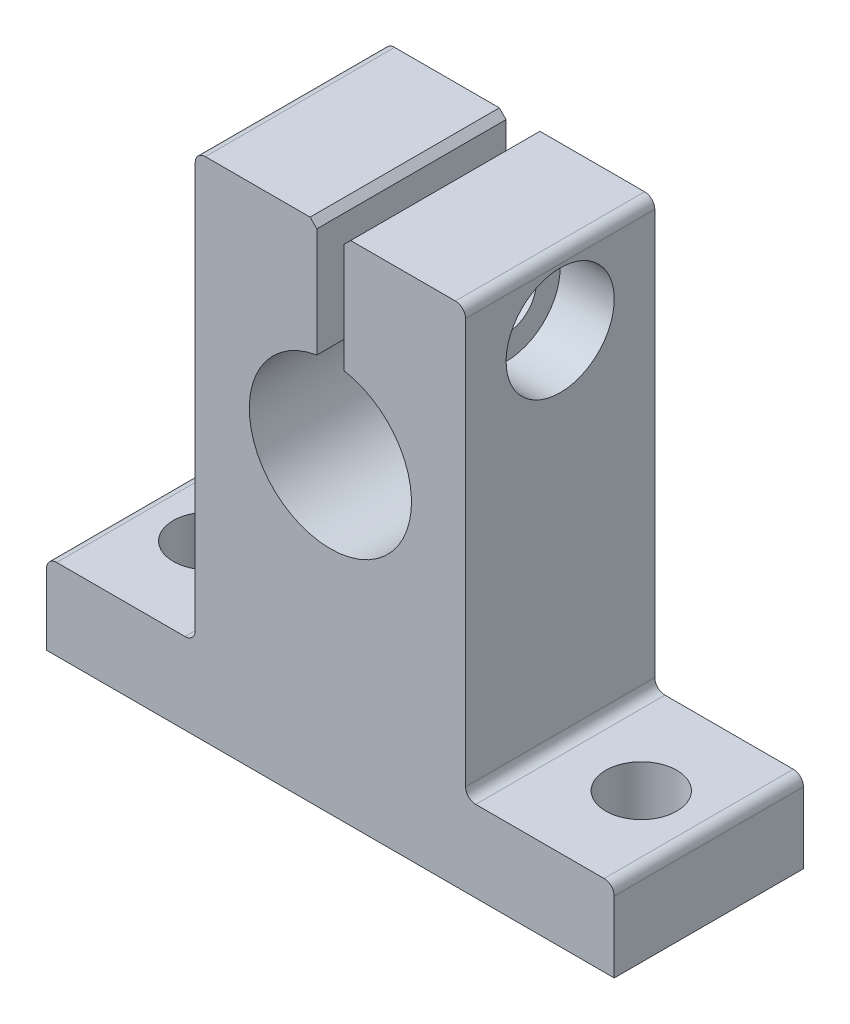
ISO-10303-21;
HEADER;
FILE_DESCRIPTION(('STEP AP214'),'2;1');
FILE_NAME('part.step','',(''),(''),'','','');
FILE_SCHEMA(('AUTOMOTIVE_DESIGN { 1 0 10303 214 1 1 1 1 }'));
ENDSEC;
DATA;
#1=APPLICATION_CONTEXT('core data for automotive mechanical design processes');
#2=APPLICATION_PROTOCOL_DEFINITION('international standard','automotive_design',2000,#1);
#3=PRODUCT_CONTEXT('',#1,'mechanical');
#4=PRODUCT('Part','Part','',(#3));
#5=PRODUCT_RELATED_PRODUCT_CATEGORY('part','',(#4));
#6=PRODUCT_DEFINITION_FORMATION('','',#4);
#7=PRODUCT_DEFINITION_CONTEXT('part definition',#1,'design');
#8=PRODUCT_DEFINITION('design','',#6,#7);
#9=PRODUCT_DEFINITION_SHAPE('','',#8);
#10=(LENGTH_UNIT() NAMED_UNIT(*) SI_UNIT(.MILLI.,.METRE.));
#11=(NAMED_UNIT(*) PLANE_ANGLE_UNIT() SI_UNIT($,.RADIAN.));
#12=(NAMED_UNIT(*) SI_UNIT($,.STERADIAN.) SOLID_ANGLE_UNIT());
#13=UNCERTAINTY_MEASURE_WITH_UNIT(LENGTH_MEASURE(1.E-05),#10,'distance_accuracy_value','');
#14=(GEOMETRIC_REPRESENTATION_CONTEXT(3) GLOBAL_UNCERTAINTY_ASSIGNED_CONTEXT((#13)) GLOBAL_UNIT_ASSIGNED_CONTEXT((#10,
#11,#12)) REPRESENTATION_CONTEXT('',''));
#15=CARTESIAN_POINT('',(0.,0.,0.));
#16=DIRECTION('',(0.,0.,1.));
#17=DIRECTION('',(1.,0.,0.));
#18=AXIS2_PLACEMENT_3D('',#15,#16,#17);
#19=CARTESIAN_POINT('',(10.,0.,14.));
#20=DIRECTION('',(-1.,0.,0.));
#21=DIRECTION('',(0.,-1.,0.));
#22=AXIS2_PLACEMENT_3D('',#19,#20,#21);
#23=PLANE('',#22);
#24=DIRECTION('',(0.,1.,0.));
#25=VECTOR('',#24,1.);
#26=CARTESIAN_POINT('',(10.,0.,14.));
#27=LINE('',#26,#25);
#28=CARTESIAN_POINT('',(10.,6.75,14.));
#29=VERTEX_POINT('',#28);
#30=CARTESIAN_POINT('',(10.,36.75,14.));
#31=VERTEX_POINT('',#30);
#32=EDGE_CURVE('E222',#29,#31,#27,.T.);
#33=ORIENTED_EDGE('',*,*,#32,.F.);
#34=DIRECTION('',(0.,0.,-1.));
#35=VECTOR('',#34,1.);
#36=CARTESIAN_POINT('',(10.,6.75,0.));
#37=LINE('',#36,#35);
#38=CARTESIAN_POINT('',(10.,6.75,0.));
#39=VERTEX_POINT('',#38);
#40=EDGE_CURVE('E262',#29,#39,#37,.T.);
#41=ORIENTED_EDGE('',*,*,#40,.T.);
#42=DIRECTION('',(0.,1.,0.));
#43=VECTOR('',#42,1.);
#44=CARTESIAN_POINT('',(10.,0.,0.));
#45=LINE('',#44,#43);
#46=CARTESIAN_POINT('',(10.,36.75,0.));
#47=VERTEX_POINT('',#46);
#48=EDGE_CURVE('E251',#39,#47,#45,.T.);
#49=ORIENTED_EDGE('',*,*,#48,.T.);
#50=DIRECTION('',(0.,0.,-1.));
#51=VECTOR('',#50,1.);
#52=CARTESIAN_POINT('',(10.,36.75,14.));
#53=LINE('',#52,#51);
#54=EDGE_CURVE('E184',#47,#31,#53,.F.);
#55=ORIENTED_EDGE('',*,*,#54,.T.);
#56=EDGE_LOOP('',(#33,#41,#49,#55));
#57=FACE_BOUND('',#56,.T.);
#58=CARTESIAN_POINT('',(10.,32.5,7.));
#59=DIRECTION('',(-1.,0.,0.));
#60=DIRECTION('',(0.,-1.,0.));
#61=AXIS2_PLACEMENT_3D('',#58,#59,#60);
#62=CIRCLE('',#61,4.);
#63=CARTESIAN_POINT('',(10.,28.5,7.));
#64=VERTEX_POINT('',#63);
#65=EDGE_CURVE('E679',#64,#64,#62,.T.);
#66=ORIENTED_EDGE('',*,*,#65,.T.);
#67=EDGE_LOOP('',(#66));
#68=FACE_BOUND('',#67,.T.);
#69=ADVANCED_FACE('F38',(#57,#68),#23,.F.);
#70=CARTESIAN_POINT('',(0.,23.,14.));
#71=DIRECTION('',(0.,0.,-1.));
#72=DIRECTION('',(-1.,0.,0.));
#73=AXIS2_PLACEMENT_3D('',#70,#71,#72);
#74=CYLINDRICAL_SURFACE('',#73,6.);
#75=CARTESIAN_POINT('',(0.,23.,0.));
#76=DIRECTION('',(0.,0.,1.));
#77=DIRECTION('',(1.,0.,0.));
#78=AXIS2_PLACEMENT_3D('',#75,#76,#77);
#79=CIRCLE('',#78,6.);
#80=CARTESIAN_POINT('',(-0.999999999999999,28.9160797830996,0.));
#81=VERTEX_POINT('',#80);
#82=CARTESIAN_POINT('',(1.,28.9160797830996,0.));
#83=VERTEX_POINT('',#82);
#84=EDGE_CURVE('E182',#81,#83,#79,.T.);
#85=ORIENTED_EDGE('',*,*,#84,.F.);
#86=DIRECTION('',(0.,0.,-1.));
#87=VECTOR('',#86,1.);
#88=CARTESIAN_POINT('',(-0.999999999999999,28.9160797830996,14.));
#89=LINE('',#88,#87);
#90=CARTESIAN_POINT('',(-0.999999999999999,28.9160797830996,14.));
#91=VERTEX_POINT('',#90);
#92=EDGE_CURVE('E176',#91,#81,#89,.T.);
#93=ORIENTED_EDGE('',*,*,#92,.F.);
#94=CARTESIAN_POINT('',(0.,23.,14.));
#95=DIRECTION('',(0.,0.,1.));
#96=DIRECTION('',(1.,0.,0.));
#97=AXIS2_PLACEMENT_3D('',#94,#95,#96);
#98=CIRCLE('',#97,6.);
#99=CARTESIAN_POINT('',(1.,28.9160797830996,14.));
#100=VERTEX_POINT('',#99);
#101=EDGE_CURVE('E180',#91,#100,#98,.T.);
#102=ORIENTED_EDGE('',*,*,#101,.T.);
#103=DIRECTION('',(0.,0.,-1.));
#104=VECTOR('',#103,1.);
#105=CARTESIAN_POINT('',(1.,28.9160797830996,14.));
#106=LINE('',#105,#104);
#107=EDGE_CURVE('E228',#100,#83,#106,.T.);
#108=ORIENTED_EDGE('',*,*,#107,.T.);
#109=EDGE_LOOP('',(#85,#93,#102,#108));
#110=FACE_BOUND('',#109,.T.);
#111=ADVANCED_FACE('F177',(#110),#74,.F.);
#112=CARTESIAN_POINT('',(-0.999999999999999,0.,14.));
#113=DIRECTION('',(-1.,0.,0.));
#114=DIRECTION('',(0.,0.,1.));
#115=AXIS2_PLACEMENT_3D('',#112,#113,#114);
#116=PLANE('',#115);
#117=CARTESIAN_POINT('',(-0.999999999999998,32.5,7.));
#118=DIRECTION('',(1.,0.,0.));
#119=DIRECTION('',(0.,0.,-1.));
#120=AXIS2_PLACEMENT_3D('',#117,#118,#119);
#121=CIRCLE('',#120,1.64999999999999);
#122=CARTESIAN_POINT('',(-0.999999999999998,32.5,5.35000000000001));
#123=VERTEX_POINT('',#122);
#124=EDGE_CURVE('E662',#123,#123,#121,.T.);
#125=ORIENTED_EDGE('',*,*,#124,.F.);
#126=EDGE_LOOP('',(#125));
#127=FACE_BOUND('',#126,.T.);
#128=DIRECTION('',(0.,1.,0.));
#129=VECTOR('',#128,1.);
#130=CARTESIAN_POINT('',(-0.999999999999999,0.,0.));
#131=LINE('',#130,#129);
#132=CARTESIAN_POINT('',(-0.999999999999999,37.,0.));
#133=VERTEX_POINT('',#132);
#134=EDGE_CURVE('E230',#81,#133,#131,.T.);
#135=ORIENTED_EDGE('',*,*,#134,.T.);
#136=DIRECTION('',(0.,0.,1.));
#137=VECTOR('',#136,1.);
#138=CARTESIAN_POINT('',(-0.999999999999999,37.,14.));
#139=LINE('',#138,#137);
#140=CARTESIAN_POINT('',(-0.999999999999998,37.,14.));
#141=VERTEX_POINT('',#140);
#142=EDGE_CURVE('E11',#133,#141,#139,.T.);
#143=ORIENTED_EDGE('',*,*,#142,.T.);
#144=DIRECTION('',(0.,1.,0.));
#145=VECTOR('',#144,1.);
#146=CARTESIAN_POINT('',(-0.999999999999999,0.,14.));
#147=LINE('',#146,#145);
#148=EDGE_CURVE('E187',#91,#141,#147,.T.);
#149=ORIENTED_EDGE('',*,*,#148,.F.);
#150=ORIENTED_EDGE('',*,*,#92,.T.);
#151=EDGE_LOOP('',(#135,#143,#149,#150));
#152=FACE_BOUND('',#151,.T.);
#153=ADVANCED_FACE('F188',(#127,#152),#116,.F.);
#154=CARTESIAN_POINT('',(0.,37.5,14.));
#155=DIRECTION('',(0.,-1.,0.));
#156=DIRECTION('',(1.,0.,0.));
#157=AXIS2_PLACEMENT_3D('',#154,#155,#156);
#158=PLANE('',#157);
#159=DIRECTION('',(-1.,0.,0.));
#160=VECTOR('',#159,1.);
#161=CARTESIAN_POINT('',(0.,37.5,14.));
#162=LINE('',#161,#160);
#163=CARTESIAN_POINT('',(-1.5,37.5,14.));
#164=VERTEX_POINT('',#163);
#165=CARTESIAN_POINT('',(-9.24999999999998,37.5,14.));
#166=VERTEX_POINT('',#165);
#167=EDGE_CURVE('E189',#164,#166,#162,.T.);
#168=ORIENTED_EDGE('',*,*,#167,.F.);
#169=DIRECTION('',(0.,0.,-1.));
#170=VECTOR('',#169,1.);
#171=CARTESIAN_POINT('',(-1.49999999999999,37.5,14.));
#172=LINE('',#171,#170);
#173=CARTESIAN_POINT('',(-1.49999999999999,37.5,0.));
#174=VERTEX_POINT('',#173);
#175=EDGE_CURVE('E47',#164,#174,#172,.T.);
#176=ORIENTED_EDGE('',*,*,#175,.T.);
#177=DIRECTION('',(-1.,0.,0.));
#178=VECTOR('',#177,1.);
#179=CARTESIAN_POINT('',(0.,37.5,0.));
#180=LINE('',#179,#178);
#181=CARTESIAN_POINT('',(-9.24999999999998,37.5,0.));
#182=VERTEX_POINT('',#181);
#183=EDGE_CURVE('E232',#174,#182,#180,.T.);
#184=ORIENTED_EDGE('',*,*,#183,.T.);
#185=DIRECTION('',(0.,0.,-1.));
#186=VECTOR('',#185,1.);
#187=CARTESIAN_POINT('',(-9.24999999999998,37.5,14.));
#188=LINE('',#187,#186);
#189=EDGE_CURVE('E305',#182,#166,#188,.F.);
#190=ORIENTED_EDGE('',*,*,#189,.T.);
#191=EDGE_LOOP('',(#168,#176,#184,#190));
#192=FACE_BOUND('',#191,.T.);
#193=ADVANCED_FACE('F332',(#192),#158,.F.);
#194=CARTESIAN_POINT('',(-10.,0.,14.));
#195=DIRECTION('',(-1.,0.,0.));
#196=DIRECTION('',(0.,-1.,0.));
#197=AXIS2_PLACEMENT_3D('',#194,#195,#196);
#198=PLANE('',#197);
#199=CARTESIAN_POINT('',(-9.99999999999999,32.5,7.));
#200=DIRECTION('',(-1.,0.,0.));
#201=DIRECTION('',(0.,-1.,0.));
#202=AXIS2_PLACEMENT_3D('',#199,#200,#201);
#203=CIRCLE('',#202,1.64999999999999);
#204=CARTESIAN_POINT('',(-9.99999999999999,30.85,7.));
#205=VERTEX_POINT('',#204);
#206=EDGE_CURVE('E201',#205,#205,#203,.T.);
#207=ORIENTED_EDGE('',*,*,#206,.F.);
#208=EDGE_LOOP('',(#207));
#209=FACE_BOUND('',#208,.T.);
#210=DIRECTION('',(0.,1.,0.));
#211=VECTOR('',#210,1.);
#212=CARTESIAN_POINT('',(-10.,0.,0.));
#213=LINE('',#212,#211);
#214=CARTESIAN_POINT('',(-10.,6.75,0.));
#215=VERTEX_POINT('',#214);
#216=CARTESIAN_POINT('',(-9.99999999999998,36.75,0.));
#217=VERTEX_POINT('',#216);
#218=EDGE_CURVE('E234',#215,#217,#213,.T.);
#219=ORIENTED_EDGE('',*,*,#218,.F.);
#220=DIRECTION('',(0.,0.,-1.));
#221=VECTOR('',#220,1.);
#222=CARTESIAN_POINT('',(-10.,6.75,14.));
#223=LINE('',#222,#221);
#224=CARTESIAN_POINT('',(-10.,6.75,14.));
#225=VERTEX_POINT('',#224);
#226=EDGE_CURVE('E278',#215,#225,#223,.F.);
#227=ORIENTED_EDGE('',*,*,#226,.T.);
#228=DIRECTION('',(0.,1.,0.));
#229=VECTOR('',#228,1.);
#230=CARTESIAN_POINT('',(-10.,0.,14.));
#231=LINE('',#230,#229);
#232=CARTESIAN_POINT('',(-9.99999999999998,36.75,14.));
#233=VERTEX_POINT('',#232);
#234=EDGE_CURVE('E205',#225,#233,#231,.T.);
#235=ORIENTED_EDGE('',*,*,#234,.T.);
#236=DIRECTION('',(0.,0.,-1.));
#237=VECTOR('',#236,1.);
#238=CARTESIAN_POINT('',(-9.99999999999998,36.75,0.));
#239=LINE('',#238,#237);
#240=EDGE_CURVE('E275',#233,#217,#239,.T.);
#241=ORIENTED_EDGE('',*,*,#240,.T.);
#242=EDGE_LOOP('',(#219,#227,#235,#241));
#243=FACE_BOUND('',#242,.T.);
#244=ADVANCED_FACE('F346',(#209,#243),#198,.T.);
#245=CARTESIAN_POINT('',(0.,5.99999999999998,14.));
#246=DIRECTION('',(0.,1.,0.));
#247=DIRECTION('',(-1.,0.,0.));
#248=AXIS2_PLACEMENT_3D('',#245,#246,#247);
#249=PLANE('',#248);
#250=CARTESIAN_POINT('',(-16.,6.00000000000001,7.));
#251=DIRECTION('',(0.,1.,0.));
#252=DIRECTION('',(-1.,0.,0.));
#253=AXIS2_PLACEMENT_3D('',#250,#251,#252);
#254=CIRCLE('',#253,2.625);
#255=CARTESIAN_POINT('',(-18.625,6.00000000000001,7.));
#256=VERTEX_POINT('',#255);
#257=EDGE_CURVE('E665',#256,#256,#254,.T.);
#258=ORIENTED_EDGE('',*,*,#257,.F.);
#259=EDGE_LOOP('',(#258));
#260=FACE_BOUND('',#259,.T.);
#261=DIRECTION('',(1.,0.,0.));
#262=VECTOR('',#261,1.);
#263=CARTESIAN_POINT('',(0.,5.99999999999998,14.));
#264=LINE('',#263,#262);
#265=CARTESIAN_POINT('',(-20.25,6.00000000000001,14.));
#266=VERTEX_POINT('',#265);
#267=CARTESIAN_POINT('',(-10.75,6.,14.));
#268=VERTEX_POINT('',#267);
#269=EDGE_CURVE('E208',#266,#268,#264,.T.);
#270=ORIENTED_EDGE('',*,*,#269,.T.);
#271=DIRECTION('',(0.,0.,-1.));
#272=VECTOR('',#271,1.);
#273=CARTESIAN_POINT('',(-10.75,6.,0.));
#274=LINE('',#273,#272);
#275=CARTESIAN_POINT('',(-10.75,6.,0.));
#276=VERTEX_POINT('',#275);
#277=EDGE_CURVE('E272',#268,#276,#274,.T.);
#278=ORIENTED_EDGE('',*,*,#277,.T.);
#279=DIRECTION('',(1.,0.,0.));
#280=VECTOR('',#279,1.);
#281=CARTESIAN_POINT('',(0.,5.99999999999998,0.));
#282=LINE('',#281,#280);
#283=CARTESIAN_POINT('',(-20.25,6.00000000000001,0.));
#284=VERTEX_POINT('',#283);
#285=EDGE_CURVE('E237',#284,#276,#282,.T.);
#286=ORIENTED_EDGE('',*,*,#285,.F.);
#287=DIRECTION('',(0.,0.,-1.));
#288=VECTOR('',#287,1.);
#289=CARTESIAN_POINT('',(-20.25,6.00000000000001,14.));
#290=LINE('',#289,#288);
#291=EDGE_CURVE('E270',#284,#266,#290,.F.);
#292=ORIENTED_EDGE('',*,*,#291,.T.);
#293=EDGE_LOOP('',(#270,#278,#286,#292));
#294=FACE_BOUND('',#293,.T.);
#295=ADVANCED_FACE('F354',(#260,#294),#249,.T.);
#296=CARTESIAN_POINT('',(-21.,0.,14.));
#297=DIRECTION('',(-1.,0.,0.));
#298=DIRECTION('',(0.,0.,1.));
#299=AXIS2_PLACEMENT_3D('',#296,#297,#298);
#300=PLANE('',#299);
#301=DIRECTION('',(0.,1.,0.));
#302=VECTOR('',#301,1.);
#303=CARTESIAN_POINT('',(-21.,0.,14.));
#304=LINE('',#303,#302);
#305=CARTESIAN_POINT('',(-21.,0.,14.));
#306=VERTEX_POINT('',#305);
#307=CARTESIAN_POINT('',(-21.,5.25000000000001,14.));
#308=VERTEX_POINT('',#307);
#309=EDGE_CURVE('E211',#306,#308,#304,.T.);
#310=ORIENTED_EDGE('',*,*,#309,.T.);
#311=DIRECTION('',(0.,0.,-1.));
#312=VECTOR('',#311,1.);
#313=CARTESIAN_POINT('',(-21.,5.25000000000001,14.));
#314=LINE('',#313,#312);
#315=CARTESIAN_POINT('',(-21.,5.25000000000001,0.));
#316=VERTEX_POINT('',#315);
#317=EDGE_CURVE('E280',#308,#316,#314,.T.);
#318=ORIENTED_EDGE('',*,*,#317,.T.);
#319=DIRECTION('',(0.,1.,0.));
#320=VECTOR('',#319,1.);
#321=CARTESIAN_POINT('',(-21.,0.,0.));
#322=LINE('',#321,#320);
#323=CARTESIAN_POINT('',(-21.,0.,0.));
#324=VERTEX_POINT('',#323);
#325=EDGE_CURVE('E240',#324,#316,#322,.T.);
#326=ORIENTED_EDGE('',*,*,#325,.F.);
#327=DIRECTION('',(0.,0.,-1.));
#328=VECTOR('',#327,1.);
#329=CARTESIAN_POINT('',(-21.,0.,14.));
#330=LINE('',#329,#328);
#331=EDGE_CURVE('E185',#306,#324,#330,.T.);
#332=ORIENTED_EDGE('',*,*,#331,.F.);
#333=EDGE_LOOP('',(#310,#318,#326,#332));
#334=FACE_BOUND('',#333,.T.);
#335=ADVANCED_FACE('F362',(#334),#300,.T.);
#336=CARTESIAN_POINT('',(0.,0.,14.));
#337=DIRECTION('',(0.,1.,0.));
#338=DIRECTION('',(-1.,0.,0.));
#339=AXIS2_PLACEMENT_3D('',#336,#337,#338);
#340=PLANE('',#339);
#341=CARTESIAN_POINT('',(16.,0.,7.));
#342=DIRECTION('',(0.,1.,0.));
#343=DIRECTION('',(-1.,0.,0.));
#344=AXIS2_PLACEMENT_3D('',#341,#342,#343);
#345=CIRCLE('',#344,2.625);
#346=CARTESIAN_POINT('',(13.375,0.,7.));
#347=VERTEX_POINT('',#346);
#348=EDGE_CURVE('E670',#347,#347,#345,.F.);
#349=ORIENTED_EDGE('',*,*,#348,.F.);
#350=EDGE_LOOP('',(#349));
#351=FACE_BOUND('',#350,.T.);
#352=CARTESIAN_POINT('',(-16.,0.,7.));
#353=DIRECTION('',(0.,1.,0.));
#354=DIRECTION('',(-1.,0.,0.));
#355=AXIS2_PLACEMENT_3D('',#352,#353,#354);
#356=CIRCLE('',#355,2.625);
#357=CARTESIAN_POINT('',(-18.625,0.,7.));
#358=VERTEX_POINT('',#357);
#359=EDGE_CURVE('E663',#358,#358,#356,.F.);
#360=ORIENTED_EDGE('',*,*,#359,.F.);
#361=EDGE_LOOP('',(#360));
#362=FACE_BOUND('',#361,.T.);
#363=DIRECTION('',(1.,0.,0.));
#364=VECTOR('',#363,1.);
#365=CARTESIAN_POINT('',(0.,0.,0.));
#366=LINE('',#365,#364);
#367=CARTESIAN_POINT('',(21.,0.,0.));
#368=VERTEX_POINT('',#367);
#369=EDGE_CURVE('E243',#324,#368,#366,.T.);
#370=ORIENTED_EDGE('',*,*,#369,.T.);
#371=DIRECTION('',(0.,0.,-1.));
#372=VECTOR('',#371,1.);
#373=CARTESIAN_POINT('',(21.,0.,14.));
#374=LINE('',#373,#372);
#375=CARTESIAN_POINT('',(21.,0.,14.));
#376=VERTEX_POINT('',#375);
#377=EDGE_CURVE('E257',#376,#368,#374,.T.);
#378=ORIENTED_EDGE('',*,*,#377,.F.);
#379=DIRECTION('',(1.,0.,0.));
#380=VECTOR('',#379,1.);
#381=CARTESIAN_POINT('',(0.,0.,14.));
#382=LINE('',#381,#380);
#383=EDGE_CURVE('E214',#306,#376,#382,.T.);
#384=ORIENTED_EDGE('',*,*,#383,.F.);
#385=ORIENTED_EDGE('',*,*,#331,.T.);
#386=EDGE_LOOP('',(#370,#378,#384,#385));
#387=FACE_BOUND('',#386,.T.);
#388=ADVANCED_FACE('F368',(#351,#362,#387),#340,.F.);
#389=CARTESIAN_POINT('',(21.,0.,14.));
#390=DIRECTION('',(-1.,0.,0.));
#391=DIRECTION('',(0.,0.,1.));
#392=AXIS2_PLACEMENT_3D('',#389,#390,#391);
#393=PLANE('',#392);
#394=DIRECTION('',(0.,1.,0.));
#395=VECTOR('',#394,1.);
#396=CARTESIAN_POINT('',(21.,0.,0.));
#397=LINE('',#396,#395);
#398=CARTESIAN_POINT('',(21.,5.25,0.));
#399=VERTEX_POINT('',#398);
#400=EDGE_CURVE('E245',#368,#399,#397,.T.);
#401=ORIENTED_EDGE('',*,*,#400,.T.);
#402=DIRECTION('',(0.,0.,-1.));
#403=VECTOR('',#402,1.);
#404=CARTESIAN_POINT('',(21.,5.25,14.));
#405=LINE('',#404,#403);
#406=CARTESIAN_POINT('',(21.,5.25,14.));
#407=VERTEX_POINT('',#406);
#408=EDGE_CURVE('E300',#399,#407,#405,.F.);
#409=ORIENTED_EDGE('',*,*,#408,.T.);
#410=DIRECTION('',(0.,1.,0.));
#411=VECTOR('',#410,1.);
#412=CARTESIAN_POINT('',(21.,0.,14.));
#413=LINE('',#412,#411);
#414=EDGE_CURVE('E216',#376,#407,#413,.T.);
#415=ORIENTED_EDGE('',*,*,#414,.F.);
#416=ORIENTED_EDGE('',*,*,#377,.T.);
#417=EDGE_LOOP('',(#401,#409,#415,#416));
#418=FACE_BOUND('',#417,.T.);
#419=ADVANCED_FACE('F426',(#418),#393,.F.);
#420=CARTESIAN_POINT('',(0.,5.99999999999999,14.));
#421=DIRECTION('',(0.,-1.,0.));
#422=DIRECTION('',(1.,0.,0.));
#423=AXIS2_PLACEMENT_3D('',#420,#421,#422);
#424=PLANE('',#423);
#425=CARTESIAN_POINT('',(16.,5.99999999999996,7.));
#426=DIRECTION('',(0.,1.,0.));
#427=DIRECTION('',(1.,0.,0.));
#428=AXIS2_PLACEMENT_3D('',#425,#426,#427);
#429=CIRCLE('',#428,2.625);
#430=CARTESIAN_POINT('',(18.625,5.99999999999995,7.));
#431=VERTEX_POINT('',#430);
#432=EDGE_CURVE('E673',#431,#431,#429,.T.);
#433=ORIENTED_EDGE('',*,*,#432,.F.);
#434=EDGE_LOOP('',(#433));
#435=FACE_BOUND('',#434,.T.);
#436=DIRECTION('',(-1.,0.,0.));
#437=VECTOR('',#436,1.);
#438=CARTESIAN_POINT('',(0.,5.99999999999999,0.));
#439=LINE('',#438,#437);
#440=CARTESIAN_POINT('',(20.25,6.,0.));
#441=VERTEX_POINT('',#440);
#442=CARTESIAN_POINT('',(10.75,6.,0.));
#443=VERTEX_POINT('',#442);
#444=EDGE_CURVE('E248',#441,#443,#439,.T.);
#445=ORIENTED_EDGE('',*,*,#444,.T.);
#446=DIRECTION('',(0.,0.,-1.));
#447=VECTOR('',#446,1.);
#448=CARTESIAN_POINT('',(10.75,6.,14.));
#449=LINE('',#448,#447);
#450=CARTESIAN_POINT('',(10.75,6.,14.));
#451=VERTEX_POINT('',#450);
#452=EDGE_CURVE('E268',#443,#451,#449,.F.);
#453=ORIENTED_EDGE('',*,*,#452,.T.);
#454=DIRECTION('',(-1.,0.,0.));
#455=VECTOR('',#454,1.);
#456=CARTESIAN_POINT('',(0.,5.99999999999999,14.));
#457=LINE('',#456,#455);
#458=CARTESIAN_POINT('',(20.25,6.,14.));
#459=VERTEX_POINT('',#458);
#460=EDGE_CURVE('E219',#459,#451,#457,.T.);
#461=ORIENTED_EDGE('',*,*,#460,.F.);
#462=DIRECTION('',(0.,0.,-1.));
#463=VECTOR('',#462,1.);
#464=CARTESIAN_POINT('',(20.25,6.,14.));
#465=LINE('',#464,#463);
#466=EDGE_CURVE('E265',#459,#441,#465,.T.);
#467=ORIENTED_EDGE('',*,*,#466,.T.);
#468=EDGE_LOOP('',(#445,#453,#461,#467));
#469=FACE_BOUND('',#468,.T.);
#470=ADVANCED_FACE('F379',(#435,#469),#424,.F.);
#471=CARTESIAN_POINT('',(0.,37.5,14.));
#472=DIRECTION('',(0.,-1.,0.));
#473=DIRECTION('',(1.,0.,0.));
#474=AXIS2_PLACEMENT_3D('',#471,#472,#473);
#475=PLANE('',#474);
#476=DIRECTION('',(-1.,0.,0.));
#477=VECTOR('',#476,1.);
#478=CARTESIAN_POINT('',(0.,37.5,0.));
#479=LINE('',#478,#477);
#480=CARTESIAN_POINT('',(9.25,37.5,0.));
#481=VERTEX_POINT('',#480);
#482=CARTESIAN_POINT('',(1.49999999999999,37.5,0.));
#483=VERTEX_POINT('',#482);
#484=EDGE_CURVE('E198',#481,#483,#479,.T.);
#485=ORIENTED_EDGE('',*,*,#484,.T.);
#486=DIRECTION('',(0.,0.,1.));
#487=VECTOR('',#486,1.);
#488=CARTESIAN_POINT('',(1.49999999999999,37.5,14.));
#489=LINE('',#488,#487);
#490=CARTESIAN_POINT('',(1.5,37.5,14.));
#491=VERTEX_POINT('',#490);
#492=EDGE_CURVE('E323',#483,#491,#489,.T.);
#493=ORIENTED_EDGE('',*,*,#492,.T.);
#494=DIRECTION('',(-1.,0.,0.));
#495=VECTOR('',#494,1.);
#496=CARTESIAN_POINT('',(0.,37.5,14.));
#497=LINE('',#496,#495);
#498=CARTESIAN_POINT('',(9.25,37.5,14.));
#499=VERTEX_POINT('',#498);
#500=EDGE_CURVE('E225',#499,#491,#497,.T.);
#501=ORIENTED_EDGE('',*,*,#500,.F.);
#502=DIRECTION('',(0.,0.,-1.));
#503=VECTOR('',#502,1.);
#504=CARTESIAN_POINT('',(9.25,37.5,14.));
#505=LINE('',#504,#503);
#506=EDGE_CURVE('E302',#499,#481,#505,.T.);
#507=ORIENTED_EDGE('',*,*,#506,.T.);
#508=EDGE_LOOP('',(#485,#493,#501,#507));
#509=FACE_BOUND('',#508,.T.);
#510=ADVANCED_FACE('F398',(#509),#475,.F.);
#511=CARTESIAN_POINT('',(1.00000000000001,0.,14.));
#512=DIRECTION('',(1.,0.,0.));
#513=DIRECTION('',(0.,1.,0.));
#514=AXIS2_PLACEMENT_3D('',#511,#512,#513);
#515=PLANE('',#514);
#516=CARTESIAN_POINT('',(1.,32.5,7.));
#517=DIRECTION('',(1.,0.,0.));
#518=DIRECTION('',(0.,1.,0.));
#519=AXIS2_PLACEMENT_3D('',#516,#517,#518);
#520=CIRCLE('',#519,2.25);
#521=CARTESIAN_POINT('',(1.,34.75,7.));
#522=VERTEX_POINT('',#521);
#523=EDGE_CURVE('E676',#522,#522,#520,.F.);
#524=ORIENTED_EDGE('',*,*,#523,.F.);
#525=EDGE_LOOP('',(#524));
#526=FACE_BOUND('',#525,.T.);
#527=DIRECTION('',(0.,-1.,0.));
#528=VECTOR('',#527,1.);
#529=CARTESIAN_POINT('',(1.00000000000001,0.,14.));
#530=LINE('',#529,#528);
#531=CARTESIAN_POINT('',(0.999999999999998,37.,14.));
#532=VERTEX_POINT('',#531);
#533=EDGE_CURVE('E194',#532,#100,#530,.T.);
#534=ORIENTED_EDGE('',*,*,#533,.F.);
#535=DIRECTION('',(0.,0.,-1.));
#536=VECTOR('',#535,1.);
#537=CARTESIAN_POINT('',(0.999999999999999,37.,14.));
#538=LINE('',#537,#536);
#539=CARTESIAN_POINT('',(0.999999999999997,37.,0.));
#540=VERTEX_POINT('',#539);
#541=EDGE_CURVE('E316',#532,#540,#538,.T.);
#542=ORIENTED_EDGE('',*,*,#541,.T.);
#543=DIRECTION('',(0.,-1.,0.));
#544=VECTOR('',#543,1.);
#545=CARTESIAN_POINT('',(1.00000000000001,0.,0.));
#546=LINE('',#545,#544);
#547=EDGE_CURVE('E196',#540,#83,#546,.T.);
#548=ORIENTED_EDGE('',*,*,#547,.T.);
#549=ORIENTED_EDGE('',*,*,#107,.F.);
#550=EDGE_LOOP('',(#534,#542,#548,#549));
#551=FACE_BOUND('',#550,.T.);
#552=ADVANCED_FACE('F405',(#526,#551),#515,.F.);
#553=CARTESIAN_POINT('',(0.,0.,14.));
#554=DIRECTION('',(0.,0.,1.));
#555=DIRECTION('',(1.,0.,0.));
#556=AXIS2_PLACEMENT_3D('',#553,#554,#555);
#557=PLANE('',#556);
#558=ORIENTED_EDGE('',*,*,#500,.T.);
#559=DIRECTION('',(0.707106781186543,0.707106781186552,0.));
#560=VECTOR('',#559,1.);
#561=CARTESIAN_POINT('',(-18.,17.9999999999997,14.));
#562=LINE('',#561,#560);
#563=EDGE_CURVE('E326',#491,#532,#562,.F.);
#564=ORIENTED_EDGE('',*,*,#563,.T.);
#565=ORIENTED_EDGE('',*,*,#533,.T.);
#566=ORIENTED_EDGE('',*,*,#101,.F.);
#567=ORIENTED_EDGE('',*,*,#148,.T.);
#568=DIRECTION('',(0.707106781186543,-0.707106781186552,0.));
#569=VECTOR('',#568,1.);
#570=CARTESIAN_POINT('',(18.,17.9999999999997,14.));
#571=LINE('',#570,#569);
#572=EDGE_CURVE('E54',#141,#164,#571,.F.);
#573=ORIENTED_EDGE('',*,*,#572,.T.);
#574=ORIENTED_EDGE('',*,*,#167,.T.);
#575=CARTESIAN_POINT('',(-9.24999999999998,36.75,14.));
#576=DIRECTION('',(0.,0.,1.));
#577=DIRECTION('',(1.,0.,0.));
#578=AXIS2_PLACEMENT_3D('',#575,#576,#577);
#579=CIRCLE('',#578,0.75);
#580=EDGE_CURVE('E292',#166,#233,#579,.T.);
#581=ORIENTED_EDGE('',*,*,#580,.T.);
#582=ORIENTED_EDGE('',*,*,#234,.F.);
#583=CARTESIAN_POINT('',(-10.75,6.75,14.));
#584=DIRECTION('',(0.,0.,1.));
#585=DIRECTION('',(1.,0.,0.));
#586=AXIS2_PLACEMENT_3D('',#583,#584,#585);
#587=CIRCLE('',#586,0.75);
#588=EDGE_CURVE('E314',#225,#268,#587,.F.);
#589=ORIENTED_EDGE('',*,*,#588,.T.);
#590=ORIENTED_EDGE('',*,*,#269,.F.);
#591=CARTESIAN_POINT('',(-20.25,5.25000000000001,14.));
#592=DIRECTION('',(0.,0.,1.));
#593=DIRECTION('',(1.,0.,0.));
#594=AXIS2_PLACEMENT_3D('',#591,#592,#593);
#595=CIRCLE('',#594,0.75);
#596=EDGE_CURVE('E298',#266,#308,#595,.T.);
#597=ORIENTED_EDGE('',*,*,#596,.T.);
#598=ORIENTED_EDGE('',*,*,#309,.F.);
#599=ORIENTED_EDGE('',*,*,#383,.T.);
#600=ORIENTED_EDGE('',*,*,#414,.T.);
#601=CARTESIAN_POINT('',(20.25,5.25,14.));
#602=DIRECTION('',(0.,0.,1.));
#603=DIRECTION('',(1.,0.,0.));
#604=AXIS2_PLACEMENT_3D('',#601,#602,#603);
#605=CIRCLE('',#604,0.75);
#606=EDGE_CURVE('E296',#407,#459,#605,.T.);
#607=ORIENTED_EDGE('',*,*,#606,.T.);
#608=ORIENTED_EDGE('',*,*,#460,.T.);
#609=CARTESIAN_POINT('',(10.75,6.75,14.));
#610=DIRECTION('',(0.,0.,1.));
#611=DIRECTION('',(1.,0.,0.));
#612=AXIS2_PLACEMENT_3D('',#609,#610,#611);
#613=CIRCLE('',#612,0.75);
#614=EDGE_CURVE('E310',#451,#29,#613,.F.);
#615=ORIENTED_EDGE('',*,*,#614,.T.);
#616=ORIENTED_EDGE('',*,*,#32,.T.);
#617=CARTESIAN_POINT('',(9.25,36.75,14.));
#618=DIRECTION('',(0.,0.,1.));
#619=DIRECTION('',(1.,0.,0.));
#620=AXIS2_PLACEMENT_3D('',#617,#618,#619);
#621=CIRCLE('',#620,0.75);
#622=EDGE_CURVE('E294',#31,#499,#621,.T.);
#623=ORIENTED_EDGE('',*,*,#622,.T.);
#624=EDGE_LOOP('',(#558,#564,#565,#566,#567,#573,#574,#581,#582,#589,#590,#597,#598,#599,#600,
#607,#608,#615,#616,#623));
#625=FACE_BOUND('',#624,.T.);
#626=ADVANCED_FACE('F192',(#625),#557,.T.);
#627=CARTESIAN_POINT('',(0.,0.,0.));
#628=DIRECTION('',(0.,0.,1.));
#629=DIRECTION('',(1.,0.,0.));
#630=AXIS2_PLACEMENT_3D('',#627,#628,#629);
#631=PLANE('',#630);
#632=ORIENTED_EDGE('',*,*,#547,.F.);
#633=DIRECTION('',(-0.707106781186543,-0.707106781186552,0.));
#634=VECTOR('',#633,1.);
#635=CARTESIAN_POINT('',(0.999999999999999,37.,0.));
#636=LINE('',#635,#634);
#637=EDGE_CURVE('E321',#540,#483,#636,.F.);
#638=ORIENTED_EDGE('',*,*,#637,.T.);
#639=ORIENTED_EDGE('',*,*,#484,.F.);
#640=CARTESIAN_POINT('',(9.25,36.75,0.));
#641=DIRECTION('',(0.,0.,1.));
#642=DIRECTION('',(1.,0.,0.));
#643=AXIS2_PLACEMENT_3D('',#640,#641,#642);
#644=CIRCLE('',#643,0.75);
#645=EDGE_CURVE('E286',#481,#47,#644,.F.);
#646=ORIENTED_EDGE('',*,*,#645,.T.);
#647=ORIENTED_EDGE('',*,*,#48,.F.);
#648=CARTESIAN_POINT('',(10.75,6.75,0.));
#649=DIRECTION('',(0.,0.,1.));
#650=DIRECTION('',(1.,0.,0.));
#651=AXIS2_PLACEMENT_3D('',#648,#649,#650);
#652=CIRCLE('',#651,0.75);
#653=EDGE_CURVE('E308',#39,#443,#652,.T.);
#654=ORIENTED_EDGE('',*,*,#653,.T.);
#655=ORIENTED_EDGE('',*,*,#444,.F.);
#656=CARTESIAN_POINT('',(20.25,5.25,0.));
#657=DIRECTION('',(0.,0.,1.));
#658=DIRECTION('',(1.,0.,0.));
#659=AXIS2_PLACEMENT_3D('',#656,#657,#658);
#660=CIRCLE('',#659,0.75);
#661=EDGE_CURVE('E288',#441,#399,#660,.F.);
#662=ORIENTED_EDGE('',*,*,#661,.T.);
#663=ORIENTED_EDGE('',*,*,#400,.F.);
#664=ORIENTED_EDGE('',*,*,#369,.F.);
#665=ORIENTED_EDGE('',*,*,#325,.T.);
#666=CARTESIAN_POINT('',(-20.25,5.25000000000001,0.));
#667=DIRECTION('',(0.,0.,1.));
#668=DIRECTION('',(1.,0.,0.));
#669=AXIS2_PLACEMENT_3D('',#666,#667,#668);
#670=CIRCLE('',#669,0.75);
#671=EDGE_CURVE('E290',#316,#284,#670,.F.);
#672=ORIENTED_EDGE('',*,*,#671,.T.);
#673=ORIENTED_EDGE('',*,*,#285,.T.);
#674=CARTESIAN_POINT('',(-10.75,6.75,0.));
#675=DIRECTION('',(0.,0.,1.));
#676=DIRECTION('',(1.,0.,0.));
#677=AXIS2_PLACEMENT_3D('',#674,#675,#676);
#678=CIRCLE('',#677,0.75);
#679=EDGE_CURVE('E312',#276,#215,#678,.T.);
#680=ORIENTED_EDGE('',*,*,#679,.T.);
#681=ORIENTED_EDGE('',*,*,#218,.T.);
#682=CARTESIAN_POINT('',(-9.24999999999998,36.75,0.));
#683=DIRECTION('',(0.,0.,1.));
#684=DIRECTION('',(1.,0.,0.));
#685=AXIS2_PLACEMENT_3D('',#682,#683,#684);
#686=CIRCLE('',#685,0.75);
#687=EDGE_CURVE('E283',#217,#182,#686,.F.);
#688=ORIENTED_EDGE('',*,*,#687,.T.);
#689=ORIENTED_EDGE('',*,*,#183,.F.);
#690=DIRECTION('',(-0.707106781186543,0.707106781186552,0.));
#691=VECTOR('',#690,1.);
#692=CARTESIAN_POINT('',(-1.49999999999999,37.5,0.));
#693=LINE('',#692,#691);
#694=EDGE_CURVE('E319',#174,#133,#693,.F.);
#695=ORIENTED_EDGE('',*,*,#694,.T.);
#696=ORIENTED_EDGE('',*,*,#134,.F.);
#697=ORIENTED_EDGE('',*,*,#84,.T.);
#698=EDGE_LOOP('',(#632,#638,#639,#646,#647,#654,#655,#662,#663,#664,#665,#672,#673,#680,#681,
#688,#689,#695,#696,#697));
#699=FACE_BOUND('',#698,.T.);
#700=ADVANCED_FACE('F336',(#699),#631,.F.);
#701=CARTESIAN_POINT('',(-0.999999999999999,32.5,7.));
#702=DIRECTION('',(1.,0.,0.));
#703=DIRECTION('',(0.,0.,-1.));
#704=AXIS2_PLACEMENT_3D('',#701,#702,#703);
#705=CYLINDRICAL_SURFACE('',#704,1.64999999999999);
#706=ORIENTED_EDGE('',*,*,#206,.T.);
#707=EDGE_LOOP('',(#706));
#708=FACE_BOUND('',#707,.T.);
#709=ORIENTED_EDGE('',*,*,#124,.T.);
#710=EDGE_LOOP('',(#709));
#711=FACE_BOUND('',#710,.T.);
#712=ADVANCED_FACE('F530',(#708,#711),#705,.F.);
#713=CARTESIAN_POINT('',(-16.,-0.00100000000000794,7.));
#714=DIRECTION('',(0.,1.,0.));
#715=DIRECTION('',(-1.,0.,0.));
#716=AXIS2_PLACEMENT_3D('',#713,#714,#715);
#717=CYLINDRICAL_SURFACE('',#716,2.625);
#718=ORIENTED_EDGE('',*,*,#257,.T.);
#719=EDGE_LOOP('',(#718));
#720=FACE_BOUND('',#719,.T.);
#721=ORIENTED_EDGE('',*,*,#359,.T.);
#722=EDGE_LOOP('',(#721));
#723=FACE_BOUND('',#722,.T.);
#724=ADVANCED_FACE('F526',(#720,#723),#717,.F.);
#725=CARTESIAN_POINT('',(16.,-0.00100000000005825,7.));
#726=DIRECTION('',(0.,1.,0.));
#727=DIRECTION('',(-1.,0.,0.));
#728=AXIS2_PLACEMENT_3D('',#725,#726,#727);
#729=CYLINDRICAL_SURFACE('',#728,2.625);
#730=ORIENTED_EDGE('',*,*,#432,.T.);
#731=EDGE_LOOP('',(#730));
#732=FACE_BOUND('',#731,.T.);
#733=ORIENTED_EDGE('',*,*,#348,.T.);
#734=EDGE_LOOP('',(#733));
#735=FACE_BOUND('',#734,.T.);
#736=ADVANCED_FACE('F448',(#732,#735),#729,.F.);
#737=CARTESIAN_POINT('',(10.75,6.75,14.));
#738=DIRECTION('',(0.,0.,1.));
#739=DIRECTION('',(1.,0.,0.));
#740=AXIS2_PLACEMENT_3D('',#737,#738,#739);
#741=CYLINDRICAL_SURFACE('',#740,0.75);
#742=ORIENTED_EDGE('',*,*,#614,.F.);
#743=ORIENTED_EDGE('',*,*,#452,.F.);
#744=ORIENTED_EDGE('',*,*,#653,.F.);
#745=ORIENTED_EDGE('',*,*,#40,.F.);
#746=EDGE_LOOP('',(#742,#743,#744,#745));
#747=FACE_BOUND('',#746,.T.);
#748=ADVANCED_FACE('F386',(#747),#741,.F.);
#749=CARTESIAN_POINT('',(-10.75,6.75,14.));
#750=DIRECTION('',(0.,0.,1.));
#751=DIRECTION('',(1.,0.,0.));
#752=AXIS2_PLACEMENT_3D('',#749,#750,#751);
#753=CYLINDRICAL_SURFACE('',#752,0.75);
#754=ORIENTED_EDGE('',*,*,#588,.F.);
#755=ORIENTED_EDGE('',*,*,#226,.F.);
#756=ORIENTED_EDGE('',*,*,#679,.F.);
#757=ORIENTED_EDGE('',*,*,#277,.F.);
#758=EDGE_LOOP('',(#754,#755,#756,#757));
#759=FACE_BOUND('',#758,.T.);
#760=ADVANCED_FACE('F349',(#759),#753,.F.);
#761=CARTESIAN_POINT('',(-20.25,5.25000000000001,14.));
#762=DIRECTION('',(0.,0.,-1.));
#763=DIRECTION('',(-1.,0.,0.));
#764=AXIS2_PLACEMENT_3D('',#761,#762,#763);
#765=CYLINDRICAL_SURFACE('',#764,0.75);
#766=ORIENTED_EDGE('',*,*,#596,.F.);
#767=ORIENTED_EDGE('',*,*,#291,.F.);
#768=ORIENTED_EDGE('',*,*,#671,.F.);
#769=ORIENTED_EDGE('',*,*,#317,.F.);
#770=EDGE_LOOP('',(#766,#767,#768,#769));
#771=FACE_BOUND('',#770,.T.);
#772=ADVANCED_FACE('F358',(#771),#765,.T.);
#773=CARTESIAN_POINT('',(20.25,5.25,14.));
#774=DIRECTION('',(0.,0.,-1.));
#775=DIRECTION('',(-1.,0.,0.));
#776=AXIS2_PLACEMENT_3D('',#773,#774,#775);
#777=CYLINDRICAL_SURFACE('',#776,0.75);
#778=ORIENTED_EDGE('',*,*,#606,.F.);
#779=ORIENTED_EDGE('',*,*,#408,.F.);
#780=ORIENTED_EDGE('',*,*,#661,.F.);
#781=ORIENTED_EDGE('',*,*,#466,.F.);
#782=EDGE_LOOP('',(#778,#779,#780,#781));
#783=FACE_BOUND('',#782,.T.);
#784=ADVANCED_FACE('F376',(#783),#777,.T.);
#785=CARTESIAN_POINT('',(9.25,36.75,14.));
#786=DIRECTION('',(0.,0.,-1.));
#787=DIRECTION('',(-1.,0.,0.));
#788=AXIS2_PLACEMENT_3D('',#785,#786,#787);
#789=CYLINDRICAL_SURFACE('',#788,0.75);
#790=ORIENTED_EDGE('',*,*,#622,.F.);
#791=ORIENTED_EDGE('',*,*,#54,.F.);
#792=ORIENTED_EDGE('',*,*,#645,.F.);
#793=ORIENTED_EDGE('',*,*,#506,.F.);
#794=EDGE_LOOP('',(#790,#791,#792,#793));
#795=FACE_BOUND('',#794,.T.);
#796=ADVANCED_FACE('F395',(#795),#789,.T.);
#797=CARTESIAN_POINT('',(-9.24999999999998,36.75,14.));
#798=DIRECTION('',(0.,0.,1.));
#799=DIRECTION('',(1.,0.,0.));
#800=AXIS2_PLACEMENT_3D('',#797,#798,#799);
#801=CYLINDRICAL_SURFACE('',#800,0.75);
#802=ORIENTED_EDGE('',*,*,#580,.F.);
#803=ORIENTED_EDGE('',*,*,#189,.F.);
#804=ORIENTED_EDGE('',*,*,#687,.F.);
#805=ORIENTED_EDGE('',*,*,#240,.F.);
#806=EDGE_LOOP('',(#802,#803,#804,#805));
#807=FACE_BOUND('',#806,.T.);
#808=ADVANCED_FACE('F342',(#807),#801,.T.);
#809=CARTESIAN_POINT('',(0.999999999999999,37.,14.));
#810=DIRECTION('',(0.707106781186552,-0.707106781186543,0.));
#811=DIRECTION('',(0.,0.,-1.));
#812=AXIS2_PLACEMENT_3D('',#809,#810,#811);
#813=PLANE('',#812);
#814=ORIENTED_EDGE('',*,*,#563,.F.);
#815=ORIENTED_EDGE('',*,*,#492,.F.);
#816=ORIENTED_EDGE('',*,*,#637,.F.);
#817=ORIENTED_EDGE('',*,*,#541,.F.);
#818=EDGE_LOOP('',(#814,#815,#816,#817));
#819=FACE_BOUND('',#818,.T.);
#820=ADVANCED_FACE('F403',(#819),#813,.F.);
#821=CARTESIAN_POINT('',(-1.49999999999999,37.5,14.));
#822=DIRECTION('',(-0.707106781186552,-0.707106781186543,0.));
#823=DIRECTION('',(0.,0.,-1.));
#824=AXIS2_PLACEMENT_3D('',#821,#822,#823);
#825=PLANE('',#824);
#826=ORIENTED_EDGE('',*,*,#572,.F.);
#827=ORIENTED_EDGE('',*,*,#142,.F.);
#828=ORIENTED_EDGE('',*,*,#694,.F.);
#829=ORIENTED_EDGE('',*,*,#175,.F.);
#830=EDGE_LOOP('',(#826,#827,#828,#829));
#831=FACE_BOUND('',#830,.T.);
#832=ADVANCED_FACE('F40',(#831),#825,.F.);
#833=CARTESIAN_POINT('',(-21.001,32.5,7.));
#834=DIRECTION('',(1.,0.,0.));
#835=DIRECTION('',(0.,1.,0.));
#836=AXIS2_PLACEMENT_3D('',#833,#834,#835);
#837=CYLINDRICAL_SURFACE('',#836,2.25);
#838=CARTESIAN_POINT('',(6.,32.5,7.));
#839=DIRECTION('',(-1.,0.,0.));
#840=DIRECTION('',(0.,-1.,0.));
#841=AXIS2_PLACEMENT_3D('',#838,#839,#840);
#842=CIRCLE('',#841,2.25);
#843=CARTESIAN_POINT('',(6.,30.25,7.));
#844=VERTEX_POINT('',#843);
#845=EDGE_CURVE('E42',#844,#844,#842,.F.);
#846=ORIENTED_EDGE('',*,*,#845,.T.);
#847=EDGE_LOOP('',(#846));
#848=FACE_BOUND('',#847,.T.);
#849=ORIENTED_EDGE('',*,*,#523,.T.);
#850=EDGE_LOOP('',(#849));
#851=FACE_BOUND('',#850,.T.);
#852=ADVANCED_FACE('F407',(#848,#851),#837,.F.);
#853=CARTESIAN_POINT('',(6.,32.5,7.));
#854=DIRECTION('',(-1.,0.,0.));
#855=DIRECTION('',(0.,-1.,0.));
#856=AXIS2_PLACEMENT_3D('',#853,#854,#855);
#857=PLANE('',#856);
#858=CARTESIAN_POINT('',(6.,32.5,7.));
#859=DIRECTION('',(-1.,0.,0.));
#860=DIRECTION('',(0.,-1.,0.));
#861=AXIS2_PLACEMENT_3D('',#858,#859,#860);
#862=CIRCLE('',#861,4.);
#863=CARTESIAN_POINT('',(6.,28.5,7.));
#864=VERTEX_POINT('',#863);
#865=EDGE_CURVE('E682',#864,#864,#862,.T.);
#866=ORIENTED_EDGE('',*,*,#865,.F.);
#867=EDGE_LOOP('',(#866));
#868=FACE_BOUND('',#867,.T.);
#869=ORIENTED_EDGE('',*,*,#845,.F.);
#870=EDGE_LOOP('',(#869));
#871=FACE_BOUND('',#870,.T.);
#872=ADVANCED_FACE('F412',(#868,#871),#857,.F.);
#873=CARTESIAN_POINT('',(6.,32.5,7.));
#874=DIRECTION('',(1.,0.,0.));
#875=DIRECTION('',(0.,1.,0.));
#876=AXIS2_PLACEMENT_3D('',#873,#874,#875);
#877=CYLINDRICAL_SURFACE('',#876,4.);
#878=ORIENTED_EDGE('',*,*,#865,.T.);
#879=EDGE_LOOP('',(#878));
#880=FACE_BOUND('',#879,.T.);
#881=ORIENTED_EDGE('',*,*,#65,.F.);
#882=EDGE_LOOP('',(#881));
#883=FACE_BOUND('',#882,.T.);
#884=ADVANCED_FACE('F507',(#880,#883),#877,.F.);
#885=CLOSED_SHELL('',(#69,#111,#153,#193,#244,#295,#335,#388,#419,#470,#510,#552,#626,#700,#712,
#724,#736,#748,#760,#772,#784,#796,#808,#820,#832,#852,#872,#884));
#886=MANIFOLD_SOLID_BREP('B2',#885);
#887=ADVANCED_BREP_SHAPE_REPRESENTATION('',(#18,#886),#14);
#888=SHAPE_DEFINITION_REPRESENTATION(#9,#887);
ENDSEC;
END-ISO-10303-21;
